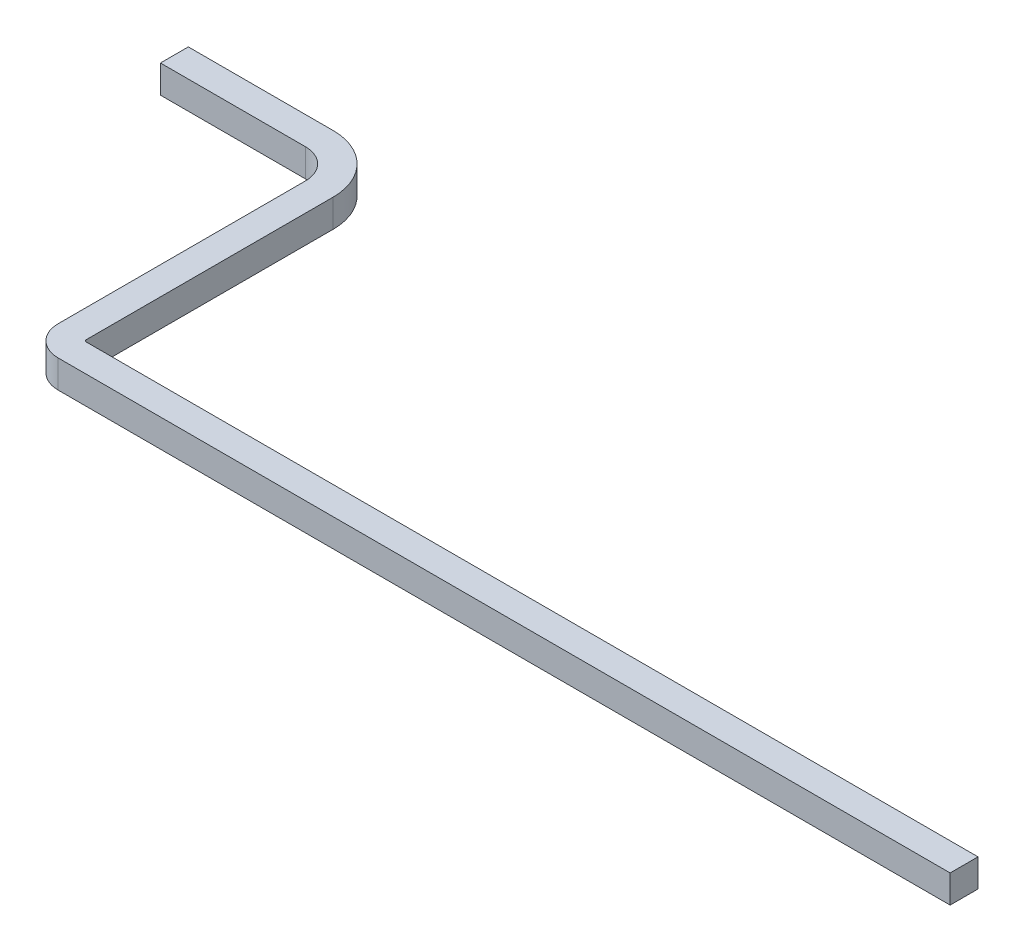
ISO-10303-21;
HEADER;
FILE_DESCRIPTION(('STEP AP214'),'2;1');
FILE_NAME('part.step','',(''),(''),'','','');
FILE_SCHEMA(('AUTOMOTIVE_DESIGN { 1 0 10303 214 1 1 1 1 }'));
ENDSEC;
DATA;
#1=APPLICATION_CONTEXT('core data for automotive mechanical design processes');
#2=APPLICATION_PROTOCOL_DEFINITION('international standard','automotive_design',2000,#1);
#3=PRODUCT_CONTEXT('',#1,'mechanical');
#4=PRODUCT('Part','Part','',(#3));
#5=PRODUCT_RELATED_PRODUCT_CATEGORY('part','',(#4));
#6=PRODUCT_DEFINITION_FORMATION('','',#4);
#7=PRODUCT_DEFINITION_CONTEXT('part definition',#1,'design');
#8=PRODUCT_DEFINITION('design','',#6,#7);
#9=PRODUCT_DEFINITION_SHAPE('','',#8);
#10=(LENGTH_UNIT() NAMED_UNIT(*) SI_UNIT(.MILLI.,.METRE.));
#11=(NAMED_UNIT(*) PLANE_ANGLE_UNIT() SI_UNIT($,.RADIAN.));
#12=(NAMED_UNIT(*) SI_UNIT($,.STERADIAN.) SOLID_ANGLE_UNIT());
#13=UNCERTAINTY_MEASURE_WITH_UNIT(LENGTH_MEASURE(1.E-05),#10,'distance_accuracy_value','');
#14=(GEOMETRIC_REPRESENTATION_CONTEXT(3) GLOBAL_UNCERTAINTY_ASSIGNED_CONTEXT((#13)) GLOBAL_UNIT_ASSIGNED_CONTEXT((#10,
#11,#12)) REPRESENTATION_CONTEXT('',''));
#15=CARTESIAN_POINT('',(0.,0.,0.));
#16=DIRECTION('',(0.,0.,1.));
#17=DIRECTION('',(1.,0.,0.));
#18=AXIS2_PLACEMENT_3D('',#15,#16,#17);
#19=CARTESIAN_POINT('',(-2.56,0.075,-0.16));
#20=DIRECTION('',(-1.,0.,0.));
#21=DIRECTION('',(0.,0.,1.));
#22=AXIS2_PLACEMENT_3D('',#19,#20,#21);
#23=PLANE('',#22);
#24=DIRECTION('',(0.,0.,-1.));
#25=VECTOR('',#24,1.);
#26=CARTESIAN_POINT('',(-2.56,-0.075,-0.16));
#27=LINE('',#26,#25);
#28=CARTESIAN_POINT('',(-2.56,-0.075,-0.16));
#29=VERTEX_POINT('',#28);
#30=CARTESIAN_POINT('',(-2.56,-0.075,-1.49));
#31=VERTEX_POINT('',#30);
#32=EDGE_CURVE('E121',#29,#31,#27,.T.);
#33=ORIENTED_EDGE('',*,*,#32,.F.);
#34=DIRECTION('',(0.,-1.,0.));
#35=VECTOR('',#34,1.);
#36=CARTESIAN_POINT('',(-2.56,0.075,-0.16));
#37=LINE('',#36,#35);
#38=CARTESIAN_POINT('',(-2.56,0.075,-0.16));
#39=VERTEX_POINT('',#38);
#40=EDGE_CURVE('E19',#39,#29,#37,.T.);
#41=ORIENTED_EDGE('',*,*,#40,.F.);
#42=DIRECTION('',(0.,0.,-1.));
#43=VECTOR('',#42,1.);
#44=CARTESIAN_POINT('',(-2.56,0.075,-0.16));
#45=LINE('',#44,#43);
#46=CARTESIAN_POINT('',(-2.56,0.075,-1.49));
#47=VERTEX_POINT('',#46);
#48=EDGE_CURVE('E144',#39,#47,#45,.T.);
#49=ORIENTED_EDGE('',*,*,#48,.T.);
#50=DIRECTION('',(0.,-1.,0.));
#51=VECTOR('',#50,1.);
#52=CARTESIAN_POINT('',(-2.56,0.075,-1.49));
#53=LINE('',#52,#51);
#54=EDGE_CURVE('E10',#47,#31,#53,.T.);
#55=ORIENTED_EDGE('',*,*,#54,.T.);
#56=EDGE_LOOP('',(#33,#41,#49,#55));
#57=FACE_BOUND('',#56,.T.);
#58=ADVANCED_FACE('F15',(#57),#23,.T.);
#59=CARTESIAN_POINT('',(-2.72,0.075,-1.49));
#60=DIRECTION('',(0.,1.,0.));
#61=DIRECTION('',(0.,0.,-1.));
#62=AXIS2_PLACEMENT_3D('',#59,#60,#61);
#63=CYLINDRICAL_SURFACE('',#62,0.16);
#64=CARTESIAN_POINT('',(-2.72,-0.075,-1.49));
#65=DIRECTION('',(0.,1.,0.));
#66=DIRECTION('',(1.,0.,0.));
#67=AXIS2_PLACEMENT_3D('',#64,#65,#66);
#68=CIRCLE('',#67,0.16);
#69=CARTESIAN_POINT('',(-2.72,-0.075,-1.65));
#70=VERTEX_POINT('',#69);
#71=EDGE_CURVE('E175',#31,#70,#68,.T.);
#72=ORIENTED_EDGE('',*,*,#71,.F.);
#73=ORIENTED_EDGE('',*,*,#54,.F.);
#74=CARTESIAN_POINT('',(-2.72,0.075,-1.49));
#75=DIRECTION('',(0.,1.,0.));
#76=DIRECTION('',(1.,0.,0.));
#77=AXIS2_PLACEMENT_3D('',#74,#75,#76);
#78=CIRCLE('',#77,0.16);
#79=CARTESIAN_POINT('',(-2.72,0.075,-1.65));
#80=VERTEX_POINT('',#79);
#81=EDGE_CURVE('E136',#47,#80,#78,.T.);
#82=ORIENTED_EDGE('',*,*,#81,.T.);
#83=DIRECTION('',(0.,-1.,0.));
#84=VECTOR('',#83,1.);
#85=CARTESIAN_POINT('',(-2.72,0.075,-1.65));
#86=LINE('',#85,#84);
#87=EDGE_CURVE('E26',#80,#70,#86,.T.);
#88=ORIENTED_EDGE('',*,*,#87,.T.);
#89=EDGE_LOOP('',(#72,#73,#82,#88));
#90=FACE_BOUND('',#89,.T.);
#91=ADVANCED_FACE('F287',(#90),#63,.F.);
#92=CARTESIAN_POINT('',(-2.72,0.075,-1.65));
#93=DIRECTION('',(0.,0.,1.));
#94=DIRECTION('',(1.,0.,0.));
#95=AXIS2_PLACEMENT_3D('',#92,#93,#94);
#96=PLANE('',#95);
#97=DIRECTION('',(-1.,0.,0.));
#98=VECTOR('',#97,1.);
#99=CARTESIAN_POINT('',(-2.72,-0.075,-1.65));
#100=LINE('',#99,#98);
#101=CARTESIAN_POINT('',(-3.5,-0.075,-1.65));
#102=VERTEX_POINT('',#101);
#103=EDGE_CURVE('E171',#70,#102,#100,.T.);
#104=ORIENTED_EDGE('',*,*,#103,.F.);
#105=ORIENTED_EDGE('',*,*,#87,.F.);
#106=DIRECTION('',(-1.,0.,0.));
#107=VECTOR('',#106,1.);
#108=CARTESIAN_POINT('',(-2.72,0.075,-1.65));
#109=LINE('',#108,#107);
#110=CARTESIAN_POINT('',(-3.5,0.075,-1.65));
#111=VERTEX_POINT('',#110);
#112=EDGE_CURVE('E127',#80,#111,#109,.T.);
#113=ORIENTED_EDGE('',*,*,#112,.T.);
#114=DIRECTION('',(0.,-1.,0.));
#115=VECTOR('',#114,1.);
#116=CARTESIAN_POINT('',(-3.5,0.075,-1.65));
#117=LINE('',#116,#115);
#118=EDGE_CURVE('E112',#111,#102,#117,.T.);
#119=ORIENTED_EDGE('',*,*,#118,.T.);
#120=EDGE_LOOP('',(#104,#105,#113,#119));
#121=FACE_BOUND('',#120,.T.);
#122=ADVANCED_FACE('F134',(#121),#96,.T.);
#123=CARTESIAN_POINT('',(2.4,0.075,-0.15));
#124=DIRECTION('',(0.,0.,1.));
#125=DIRECTION('',(1.,0.,0.));
#126=AXIS2_PLACEMENT_3D('',#123,#124,#125);
#127=PLANE('',#126);
#128=DIRECTION('',(-1.,0.,0.));
#129=VECTOR('',#128,1.);
#130=CARTESIAN_POINT('',(2.4,-0.075,-0.15));
#131=LINE('',#130,#129);
#132=CARTESIAN_POINT('',(2.4,-0.075,-0.15));
#133=VERTEX_POINT('',#132);
#134=CARTESIAN_POINT('',(-2.4,-0.075,-0.15));
#135=VERTEX_POINT('',#134);
#136=EDGE_CURVE('E205',#133,#135,#131,.T.);
#137=ORIENTED_EDGE('',*,*,#136,.T.);
#138=DIRECTION('',(0.,-1.,0.));
#139=VECTOR('',#138,1.);
#140=CARTESIAN_POINT('',(-2.4,0.075,-0.15));
#141=LINE('',#140,#139);
#142=CARTESIAN_POINT('',(-2.4,0.075,-0.15));
#143=VERTEX_POINT('',#142);
#144=EDGE_CURVE('E40',#143,#135,#141,.T.);
#145=ORIENTED_EDGE('',*,*,#144,.F.);
#146=DIRECTION('',(-1.,0.,0.));
#147=VECTOR('',#146,1.);
#148=CARTESIAN_POINT('',(2.4,0.075,-0.15));
#149=LINE('',#148,#147);
#150=CARTESIAN_POINT('',(2.4,0.075,-0.15));
#151=VERTEX_POINT('',#150);
#152=EDGE_CURVE('E163',#151,#143,#149,.T.);
#153=ORIENTED_EDGE('',*,*,#152,.F.);
#154=DIRECTION('',(0.,-1.,0.));
#155=VECTOR('',#154,1.);
#156=CARTESIAN_POINT('',(2.4,0.075,-0.15));
#157=LINE('',#156,#155);
#158=EDGE_CURVE('E155',#151,#133,#157,.T.);
#159=ORIENTED_EDGE('',*,*,#158,.T.);
#160=EDGE_LOOP('',(#137,#145,#153,#159));
#161=FACE_BOUND('',#160,.T.);
#162=ADVANCED_FACE('F282',(#161),#127,.F.);
#163=CARTESIAN_POINT('',(-2.4,0.075,-0.16));
#164=DIRECTION('',(0.,1.,0.));
#165=DIRECTION('',(0.,0.,-1.));
#166=AXIS2_PLACEMENT_3D('',#163,#164,#165);
#167=CYLINDRICAL_SURFACE('',#166,0.01);
#168=CARTESIAN_POINT('',(-2.4,-0.075,-0.16));
#169=DIRECTION('',(0.,-1.,0.));
#170=DIRECTION('',(0.,0.,-1.));
#171=AXIS2_PLACEMENT_3D('',#168,#169,#170);
#172=CIRCLE('',#171,0.01);
#173=CARTESIAN_POINT('',(-2.41,-0.075,-0.16));
#174=VERTEX_POINT('',#173);
#175=EDGE_CURVE('E151',#135,#174,#172,.T.);
#176=ORIENTED_EDGE('',*,*,#175,.T.);
#177=DIRECTION('',(0.,-1.,0.));
#178=VECTOR('',#177,1.);
#179=CARTESIAN_POINT('',(-2.41,0.075,-0.16));
#180=LINE('',#179,#178);
#181=CARTESIAN_POINT('',(-2.41,0.075,-0.16));
#182=VERTEX_POINT('',#181);
#183=EDGE_CURVE('E193',#182,#174,#180,.T.);
#184=ORIENTED_EDGE('',*,*,#183,.F.);
#185=CARTESIAN_POINT('',(-2.4,0.075,-0.16));
#186=DIRECTION('',(0.,-1.,0.));
#187=DIRECTION('',(0.,0.,-1.));
#188=AXIS2_PLACEMENT_3D('',#185,#186,#187);
#189=CIRCLE('',#188,0.01);
#190=EDGE_CURVE('E159',#143,#182,#189,.T.);
#191=ORIENTED_EDGE('',*,*,#190,.F.);
#192=ORIENTED_EDGE('',*,*,#144,.T.);
#193=EDGE_LOOP('',(#176,#184,#191,#192));
#194=FACE_BOUND('',#193,.T.);
#195=ADVANCED_FACE('F260',(#194),#167,.F.);
#196=CARTESIAN_POINT('',(-2.41,0.075,-0.16));
#197=DIRECTION('',(-1.,0.,0.));
#198=DIRECTION('',(0.,0.,1.));
#199=AXIS2_PLACEMENT_3D('',#196,#197,#198);
#200=PLANE('',#199);
#201=DIRECTION('',(0.,0.,-1.));
#202=VECTOR('',#201,1.);
#203=CARTESIAN_POINT('',(-2.41,-0.075,-0.16));
#204=LINE('',#203,#202);
#205=CARTESIAN_POINT('',(-2.41,-0.075,-1.49));
#206=VERTEX_POINT('',#205);
#207=EDGE_CURVE('E245',#174,#206,#204,.T.);
#208=ORIENTED_EDGE('',*,*,#207,.T.);
#209=DIRECTION('',(0.,-1.,0.));
#210=VECTOR('',#209,1.);
#211=CARTESIAN_POINT('',(-2.41,0.075,-1.49));
#212=LINE('',#211,#210);
#213=CARTESIAN_POINT('',(-2.41,0.075,-1.49));
#214=VERTEX_POINT('',#213);
#215=EDGE_CURVE('E191',#214,#206,#212,.T.);
#216=ORIENTED_EDGE('',*,*,#215,.F.);
#217=DIRECTION('',(0.,0.,-1.));
#218=VECTOR('',#217,1.);
#219=CARTESIAN_POINT('',(-2.41,0.075,-0.16));
#220=LINE('',#219,#218);
#221=EDGE_CURVE('E162',#182,#214,#220,.T.);
#222=ORIENTED_EDGE('',*,*,#221,.F.);
#223=ORIENTED_EDGE('',*,*,#183,.T.);
#224=EDGE_LOOP('',(#208,#216,#222,#223));
#225=FACE_BOUND('',#224,.T.);
#226=ADVANCED_FACE('F273',(#225),#200,.F.);
#227=CARTESIAN_POINT('',(-2.72,0.075,-1.49));
#228=DIRECTION('',(0.,1.,0.));
#229=DIRECTION('',(0.,0.,-1.));
#230=AXIS2_PLACEMENT_3D('',#227,#228,#229);
#231=CYLINDRICAL_SURFACE('',#230,0.31);
#232=CARTESIAN_POINT('',(-2.72,-0.075,-1.49));
#233=DIRECTION('',(0.,1.,0.));
#234=DIRECTION('',(0.,0.,-1.));
#235=AXIS2_PLACEMENT_3D('',#232,#233,#234);
#236=CIRCLE('',#235,0.31);
#237=CARTESIAN_POINT('',(-2.72,-0.075,-1.8));
#238=VERTEX_POINT('',#237);
#239=EDGE_CURVE('E238',#206,#238,#236,.T.);
#240=ORIENTED_EDGE('',*,*,#239,.T.);
#241=DIRECTION('',(0.,-1.,0.));
#242=VECTOR('',#241,1.);
#243=CARTESIAN_POINT('',(-2.72,0.075,-1.8));
#244=LINE('',#243,#242);
#245=CARTESIAN_POINT('',(-2.72,0.075,-1.8));
#246=VERTEX_POINT('',#245);
#247=EDGE_CURVE('E194',#246,#238,#244,.T.);
#248=ORIENTED_EDGE('',*,*,#247,.F.);
#249=CARTESIAN_POINT('',(-2.72,0.075,-1.49));
#250=DIRECTION('',(0.,1.,0.));
#251=DIRECTION('',(0.,0.,-1.));
#252=AXIS2_PLACEMENT_3D('',#249,#250,#251);
#253=CIRCLE('',#252,0.31);
#254=EDGE_CURVE('E177',#214,#246,#253,.T.);
#255=ORIENTED_EDGE('',*,*,#254,.F.);
#256=ORIENTED_EDGE('',*,*,#215,.T.);
#257=EDGE_LOOP('',(#240,#248,#255,#256));
#258=FACE_BOUND('',#257,.T.);
#259=ADVANCED_FACE('F265',(#258),#231,.T.);
#260=CARTESIAN_POINT('',(-2.72,0.075,-1.8));
#261=DIRECTION('',(0.,0.,1.));
#262=DIRECTION('',(1.,0.,0.));
#263=AXIS2_PLACEMENT_3D('',#260,#261,#262);
#264=PLANE('',#263);
#265=DIRECTION('',(-1.,0.,0.));
#266=VECTOR('',#265,1.);
#267=CARTESIAN_POINT('',(-2.72,-0.075,-1.8));
#268=LINE('',#267,#266);
#269=CARTESIAN_POINT('',(-3.5,-0.075,-1.8));
#270=VERTEX_POINT('',#269);
#271=EDGE_CURVE('E174',#238,#270,#268,.T.);
#272=ORIENTED_EDGE('',*,*,#271,.T.);
#273=DIRECTION('',(0.,-1.,0.));
#274=VECTOR('',#273,1.);
#275=CARTESIAN_POINT('',(-3.5,0.075,-1.8));
#276=LINE('',#275,#274);
#277=CARTESIAN_POINT('',(-3.5,0.075,-1.8));
#278=VERTEX_POINT('',#277);
#279=EDGE_CURVE('E132',#278,#270,#276,.T.);
#280=ORIENTED_EDGE('',*,*,#279,.F.);
#281=DIRECTION('',(-1.,0.,0.));
#282=VECTOR('',#281,1.);
#283=CARTESIAN_POINT('',(-2.72,0.075,-1.8));
#284=LINE('',#283,#282);
#285=EDGE_CURVE('E130',#246,#278,#284,.T.);
#286=ORIENTED_EDGE('',*,*,#285,.F.);
#287=ORIENTED_EDGE('',*,*,#247,.T.);
#288=EDGE_LOOP('',(#272,#280,#286,#287));
#289=FACE_BOUND('',#288,.T.);
#290=ADVANCED_FACE('F270',(#289),#264,.F.);
#291=CARTESIAN_POINT('',(2.4,-0.075,0.));
#292=DIRECTION('',(0.,1.,0.));
#293=DIRECTION('',(1.,0.,0.));
#294=AXIS2_PLACEMENT_3D('',#291,#292,#293);
#295=PLANE('',#294);
#296=DIRECTION('',(-1.,0.,0.));
#297=VECTOR('',#296,1.);
#298=CARTESIAN_POINT('',(2.4,-0.075,0.));
#299=LINE('',#298,#297);
#300=CARTESIAN_POINT('',(2.4,-0.075,0.));
#301=VERTEX_POINT('',#300);
#302=CARTESIAN_POINT('',(-2.4,-0.075,0.));
#303=VERTEX_POINT('',#302);
#304=EDGE_CURVE('E221',#301,#303,#299,.T.);
#305=ORIENTED_EDGE('',*,*,#304,.T.);
#306=CARTESIAN_POINT('',(-2.4,-0.075,-0.16));
#307=DIRECTION('',(0.,-1.,0.));
#308=DIRECTION('',(1.,0.,0.));
#309=AXIS2_PLACEMENT_3D('',#306,#307,#308);
#310=CIRCLE('',#309,0.16);
#311=EDGE_CURVE('E165',#303,#29,#310,.T.);
#312=ORIENTED_EDGE('',*,*,#311,.T.);
#313=ORIENTED_EDGE('',*,*,#32,.T.);
#314=ORIENTED_EDGE('',*,*,#71,.T.);
#315=ORIENTED_EDGE('',*,*,#103,.T.);
#316=DIRECTION('',(0.,0.,1.));
#317=VECTOR('',#316,1.);
#318=CARTESIAN_POINT('',(-3.5,-0.075,-1.65));
#319=LINE('',#318,#317);
#320=EDGE_CURVE('E119',#270,#102,#319,.T.);
#321=ORIENTED_EDGE('',*,*,#320,.F.);
#322=ORIENTED_EDGE('',*,*,#271,.F.);
#323=ORIENTED_EDGE('',*,*,#239,.F.);
#324=ORIENTED_EDGE('',*,*,#207,.F.);
#325=ORIENTED_EDGE('',*,*,#175,.F.);
#326=ORIENTED_EDGE('',*,*,#136,.F.);
#327=DIRECTION('',(0.,0.,1.));
#328=VECTOR('',#327,1.);
#329=CARTESIAN_POINT('',(2.4,-0.075,0.));
#330=LINE('',#329,#328);
#331=EDGE_CURVE('E137',#133,#301,#330,.T.);
#332=ORIENTED_EDGE('',*,*,#331,.T.);
#333=EDGE_LOOP('',(#305,#312,#313,#314,#315,#321,#322,#323,#324,#325,#326,#332));
#334=FACE_BOUND('',#333,.T.);
#335=ADVANCED_FACE('F263',(#334),#295,.F.);
#336=CARTESIAN_POINT('',(-3.5,0.075,-1.65));
#337=DIRECTION('',(-1.,0.,0.));
#338=DIRECTION('',(0.,0.,1.));
#339=AXIS2_PLACEMENT_3D('',#336,#337,#338);
#340=PLANE('',#339);
#341=DIRECTION('',(0.,0.,1.));
#342=VECTOR('',#341,1.);
#343=CARTESIAN_POINT('',(-3.5,0.075,-1.65));
#344=LINE('',#343,#342);
#345=EDGE_CURVE('E116',#278,#111,#344,.T.);
#346=ORIENTED_EDGE('',*,*,#345,.F.);
#347=ORIENTED_EDGE('',*,*,#279,.T.);
#348=ORIENTED_EDGE('',*,*,#320,.T.);
#349=ORIENTED_EDGE('',*,*,#118,.F.);
#350=EDGE_LOOP('',(#346,#347,#348,#349));
#351=FACE_BOUND('',#350,.T.);
#352=ADVANCED_FACE('F114',(#351),#340,.T.);
#353=CARTESIAN_POINT('',(-2.72,0.075,-1.65));
#354=DIRECTION('',(0.,1.,0.));
#355=DIRECTION('',(1.,0.,0.));
#356=AXIS2_PLACEMENT_3D('',#353,#354,#355);
#357=PLANE('',#356);
#358=ORIENTED_EDGE('',*,*,#112,.F.);
#359=ORIENTED_EDGE('',*,*,#81,.F.);
#360=ORIENTED_EDGE('',*,*,#48,.F.);
#361=CARTESIAN_POINT('',(-2.4,0.075,-0.16));
#362=DIRECTION('',(0.,-1.,0.));
#363=DIRECTION('',(1.,0.,0.));
#364=AXIS2_PLACEMENT_3D('',#361,#362,#363);
#365=CIRCLE('',#364,0.16);
#366=CARTESIAN_POINT('',(-2.4,0.075,0.));
#367=VERTEX_POINT('',#366);
#368=EDGE_CURVE('E169',#367,#39,#365,.T.);
#369=ORIENTED_EDGE('',*,*,#368,.F.);
#370=DIRECTION('',(-1.,0.,0.));
#371=VECTOR('',#370,1.);
#372=CARTESIAN_POINT('',(2.4,0.075,0.));
#373=LINE('',#372,#371);
#374=CARTESIAN_POINT('',(2.4,0.075,0.));
#375=VERTEX_POINT('',#374);
#376=EDGE_CURVE('E220',#375,#367,#373,.T.);
#377=ORIENTED_EDGE('',*,*,#376,.F.);
#378=DIRECTION('',(0.,0.,1.));
#379=VECTOR('',#378,1.);
#380=CARTESIAN_POINT('',(2.4,0.075,0.));
#381=LINE('',#380,#379);
#382=EDGE_CURVE('E147',#151,#375,#381,.T.);
#383=ORIENTED_EDGE('',*,*,#382,.F.);
#384=ORIENTED_EDGE('',*,*,#152,.T.);
#385=ORIENTED_EDGE('',*,*,#190,.T.);
#386=ORIENTED_EDGE('',*,*,#221,.T.);
#387=ORIENTED_EDGE('',*,*,#254,.T.);
#388=ORIENTED_EDGE('',*,*,#285,.T.);
#389=ORIENTED_EDGE('',*,*,#345,.T.);
#390=EDGE_LOOP('',(#358,#359,#360,#369,#377,#383,#384,#385,#386,#387,#388,#389));
#391=FACE_BOUND('',#390,.T.);
#392=ADVANCED_FACE('F125',(#391),#357,.T.);
#393=CARTESIAN_POINT('',(2.4,0.075,0.));
#394=DIRECTION('',(-1.,0.,0.));
#395=DIRECTION('',(0.,0.,1.));
#396=AXIS2_PLACEMENT_3D('',#393,#394,#395);
#397=PLANE('',#396);
#398=ORIENTED_EDGE('',*,*,#158,.F.);
#399=ORIENTED_EDGE('',*,*,#382,.T.);
#400=DIRECTION('',(0.,-1.,0.));
#401=VECTOR('',#400,1.);
#402=CARTESIAN_POINT('',(2.4,0.075,0.));
#403=LINE('',#402,#401);
#404=EDGE_CURVE('E225',#375,#301,#403,.T.);
#405=ORIENTED_EDGE('',*,*,#404,.T.);
#406=ORIENTED_EDGE('',*,*,#331,.F.);
#407=EDGE_LOOP('',(#398,#399,#405,#406));
#408=FACE_BOUND('',#407,.T.);
#409=ADVANCED_FACE('F17',(#408),#397,.F.);
#410=CARTESIAN_POINT('',(-2.4,0.075,-0.16));
#411=DIRECTION('',(0.,1.,0.));
#412=DIRECTION('',(0.,0.,-1.));
#413=AXIS2_PLACEMENT_3D('',#410,#411,#412);
#414=CYLINDRICAL_SURFACE('',#413,0.16);
#415=ORIENTED_EDGE('',*,*,#311,.F.);
#416=DIRECTION('',(0.,-1.,0.));
#417=VECTOR('',#416,1.);
#418=CARTESIAN_POINT('',(-2.4,0.075,0.));
#419=LINE('',#418,#417);
#420=EDGE_CURVE('E170',#367,#303,#419,.T.);
#421=ORIENTED_EDGE('',*,*,#420,.F.);
#422=ORIENTED_EDGE('',*,*,#368,.T.);
#423=ORIENTED_EDGE('',*,*,#40,.T.);
#424=EDGE_LOOP('',(#415,#421,#422,#423));
#425=FACE_BOUND('',#424,.T.);
#426=ADVANCED_FACE('F320',(#425),#414,.T.);
#427=CARTESIAN_POINT('',(2.4,0.075,0.));
#428=DIRECTION('',(0.,0.,1.));
#429=DIRECTION('',(1.,0.,0.));
#430=AXIS2_PLACEMENT_3D('',#427,#428,#429);
#431=PLANE('',#430);
#432=ORIENTED_EDGE('',*,*,#304,.F.);
#433=ORIENTED_EDGE('',*,*,#404,.F.);
#434=ORIENTED_EDGE('',*,*,#376,.T.);
#435=ORIENTED_EDGE('',*,*,#420,.T.);
#436=EDGE_LOOP('',(#432,#433,#434,#435));
#437=FACE_BOUND('',#436,.T.);
#438=ADVANCED_FACE('F313',(#437),#431,.T.);
#439=CLOSED_SHELL('',(#58,#91,#122,#162,#195,#226,#259,#290,#335,#352,#392,#409,#426,#438));
#440=MANIFOLD_SOLID_BREP('B1',#439);
#441=ADVANCED_BREP_SHAPE_REPRESENTATION('',(#18,#440),#14);
#442=SHAPE_DEFINITION_REPRESENTATION(#9,#441);
ENDSEC;
END-ISO-10303-21;
